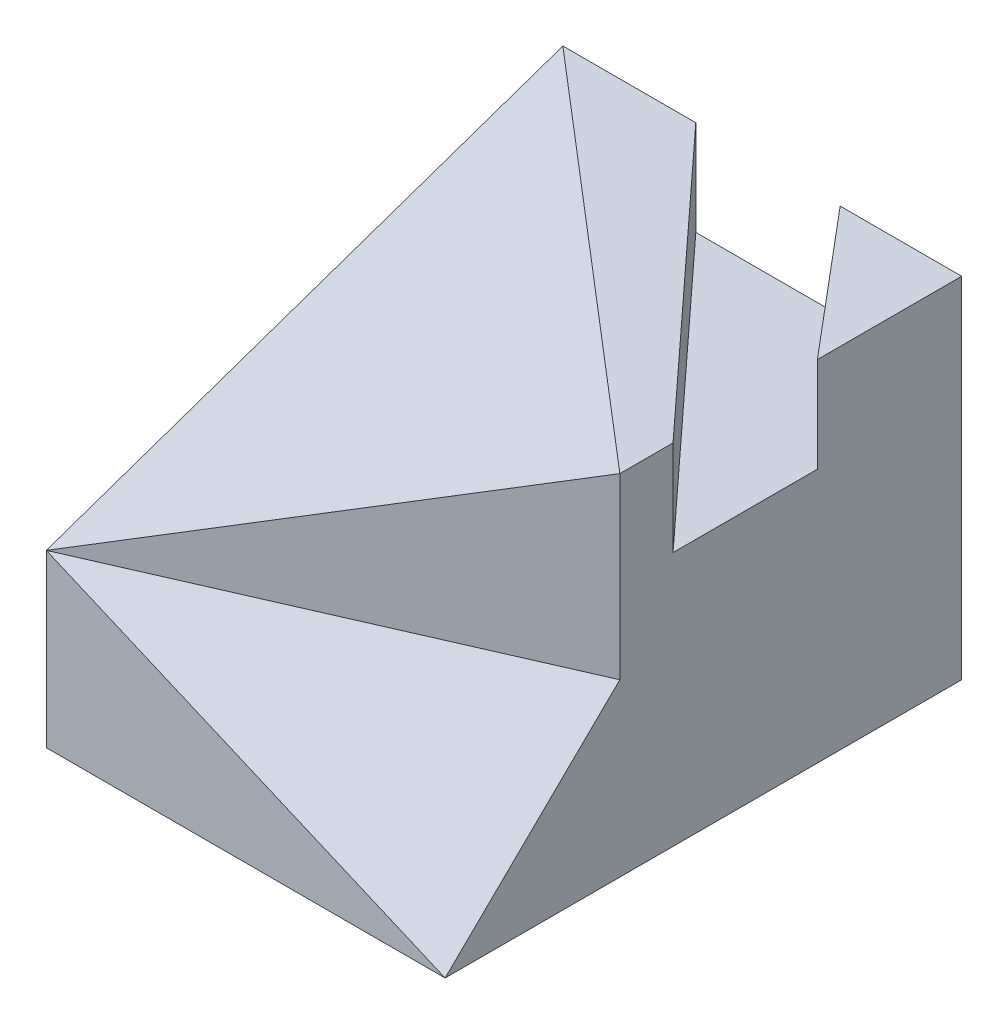
ISO-10303-21;
HEADER;
FILE_DESCRIPTION(('STEP AP214'),'2;1');
FILE_NAME('part.step','',(''),(''),'','','');
FILE_SCHEMA(('AUTOMOTIVE_DESIGN { 1 0 10303 214 1 1 1 1 }'));
ENDSEC;
DATA;
#1=APPLICATION_CONTEXT('core data for automotive mechanical design processes');
#2=APPLICATION_PROTOCOL_DEFINITION('international standard','automotive_design',2000,#1);
#3=PRODUCT_CONTEXT('',#1,'mechanical');
#4=PRODUCT('Part','Part','',(#3));
#5=PRODUCT_RELATED_PRODUCT_CATEGORY('part','',(#4));
#6=PRODUCT_DEFINITION_FORMATION('','',#4);
#7=PRODUCT_DEFINITION_CONTEXT('part definition',#1,'design');
#8=PRODUCT_DEFINITION('design','',#6,#7);
#9=PRODUCT_DEFINITION_SHAPE('','',#8);
#10=(LENGTH_UNIT() NAMED_UNIT(*) SI_UNIT(.MILLI.,.METRE.));
#11=(NAMED_UNIT(*) PLANE_ANGLE_UNIT() SI_UNIT($,.RADIAN.));
#12=(NAMED_UNIT(*) SI_UNIT($,.STERADIAN.) SOLID_ANGLE_UNIT());
#13=UNCERTAINTY_MEASURE_WITH_UNIT(LENGTH_MEASURE(1.E-05),#10,'distance_accuracy_value','');
#14=(GEOMETRIC_REPRESENTATION_CONTEXT(3) GLOBAL_UNCERTAINTY_ASSIGNED_CONTEXT((#13)) GLOBAL_UNIT_ASSIGNED_CONTEXT((#10,
#11,#12)) REPRESENTATION_CONTEXT('',''));
#15=CARTESIAN_POINT('',(0.,0.,0.));
#16=DIRECTION('',(0.,0.,1.));
#17=DIRECTION('',(1.,0.,0.));
#18=AXIS2_PLACEMENT_3D('',#15,#16,#17);
#19=CARTESIAN_POINT('',(-26.25,23.,68.));
#20=DIRECTION('',(0.,-1.,0.));
#21=DIRECTION('',(0.,0.,-1.));
#22=AXIS2_PLACEMENT_3D('',#19,#20,#21);
#23=PLANE('',#22);
#24=DIRECTION('',(-1.,0.,0.));
#25=VECTOR('',#24,1.);
#26=CARTESIAN_POINT('',(-26.25,23.,0.));
#27=LINE('',#26,#25);
#28=CARTESIAN_POINT('',(26.25,23.,0.));
#29=VERTEX_POINT('',#28);
#30=CARTESIAN_POINT('',(10.25,23.,0.));
#31=VERTEX_POINT('',#30);
#32=EDGE_CURVE('E89',#29,#31,#27,.T.);
#33=ORIENTED_EDGE('',*,*,#32,.T.);
#34=DIRECTION('',(-0.64413574578278,0.,-0.764911198117051));
#35=VECTOR('',#34,1.);
#36=CARTESIAN_POINT('',(10.25,23.,0.));
#37=LINE('',#36,#35);
#38=CARTESIAN_POINT('',(26.25,23.,19.));
#39=VERTEX_POINT('',#38);
#40=EDGE_CURVE('E235',#39,#31,#37,.T.);
#41=ORIENTED_EDGE('',*,*,#40,.F.);
#42=DIRECTION('',(0.,0.,-1.));
#43=VECTOR('',#42,1.);
#44=CARTESIAN_POINT('',(26.25,23.,68.));
#45=LINE('',#44,#43);
#46=EDGE_CURVE('E41',#39,#29,#45,.T.);
#47=ORIENTED_EDGE('',*,*,#46,.T.);
#48=EDGE_LOOP('',(#33,#41,#47));
#49=FACE_BOUND('',#48,.T.);
#50=ADVANCED_FACE('F37',(#49),#23,.F.);
#51=CARTESIAN_POINT('',(0.,0.,68.));
#52=DIRECTION('',(0.,0.,-1.));
#53=DIRECTION('',(-1.,0.,0.));
#54=AXIS2_PLACEMENT_3D('',#51,#52,#53);
#55=PLANE('',#54);
#56=DIRECTION('',(0.919145030018058,-0.393919298579168,0.));
#57=VECTOR('',#56,1.);
#58=CARTESIAN_POINT('',(-26.25,-0.499999999999988,68.));
#59=LINE('',#58,#57);
#60=CARTESIAN_POINT('',(-26.25,-0.499999999999988,68.));
#61=VERTEX_POINT('',#60);
#62=CARTESIAN_POINT('',(26.25,-23.,68.));
#63=VERTEX_POINT('',#62);
#64=EDGE_CURVE('E129',#61,#63,#59,.T.);
#65=ORIENTED_EDGE('',*,*,#64,.F.);
#66=DIRECTION('',(0.,-1.,0.));
#67=VECTOR('',#66,1.);
#68=CARTESIAN_POINT('',(-26.25,-23.,68.));
#69=LINE('',#68,#67);
#70=CARTESIAN_POINT('',(-26.25,-23.,68.));
#71=VERTEX_POINT('',#70);
#72=EDGE_CURVE('E63',#61,#71,#69,.T.);
#73=ORIENTED_EDGE('',*,*,#72,.T.);
#74=DIRECTION('',(1.,0.,0.));
#75=VECTOR('',#74,1.);
#76=CARTESIAN_POINT('',(-26.25,-23.,68.));
#77=LINE('',#76,#75);
#78=EDGE_CURVE('E95',#71,#63,#77,.T.);
#79=ORIENTED_EDGE('',*,*,#78,.T.);
#80=EDGE_LOOP('',(#65,#73,#79));
#81=FACE_BOUND('',#80,.T.);
#82=ADVANCED_FACE('F126',(#81),#55,.F.);
#83=CARTESIAN_POINT('',(26.25,-23.,68.));
#84=DIRECTION('',(-1.,0.,0.));
#85=DIRECTION('',(0.,0.,1.));
#86=AXIS2_PLACEMENT_3D('',#83,#84,#85);
#87=PLANE('',#86);
#88=ORIENTED_EDGE('',*,*,#46,.F.);
#89=DIRECTION('',(0.,1.,0.));
#90=VECTOR('',#89,1.);
#91=CARTESIAN_POINT('',(26.25,10.5,19.));
#92=LINE('',#91,#90);
#93=CARTESIAN_POINT('',(26.25,10.5,19.));
#94=VERTEX_POINT('',#93);
#95=EDGE_CURVE('E238',#94,#39,#92,.T.);
#96=ORIENTED_EDGE('',*,*,#95,.F.);
#97=DIRECTION('',(0.,0.,-1.));
#98=VECTOR('',#97,1.);
#99=CARTESIAN_POINT('',(26.25,10.5,19.));
#100=LINE('',#99,#98);
#101=CARTESIAN_POINT('',(26.25,10.5,38.));
#102=VERTEX_POINT('',#101);
#103=EDGE_CURVE('E230',#102,#94,#100,.T.);
#104=ORIENTED_EDGE('',*,*,#103,.F.);
#105=DIRECTION('',(0.,1.,0.));
#106=VECTOR('',#105,1.);
#107=CARTESIAN_POINT('',(26.25,10.5,38.));
#108=LINE('',#107,#106);
#109=CARTESIAN_POINT('',(26.25,23.,38.));
#110=VERTEX_POINT('',#109);
#111=EDGE_CURVE('E207',#102,#110,#108,.T.);
#112=ORIENTED_EDGE('',*,*,#111,.T.);
#113=CARTESIAN_POINT('',(26.25,23.,45.));
#114=VERTEX_POINT('',#113);
#115=EDGE_CURVE('E12',#114,#110,#45,.T.);
#116=ORIENTED_EDGE('',*,*,#115,.F.);
#117=DIRECTION('',(0.,1.,0.));
#118=VECTOR('',#117,1.);
#119=CARTESIAN_POINT('',(26.25,-0.499999999999997,45.));
#120=LINE('',#119,#118);
#121=CARTESIAN_POINT('',(26.25,-0.499999999999997,45.));
#122=VERTEX_POINT('',#121);
#123=EDGE_CURVE('E141',#122,#114,#120,.T.);
#124=ORIENTED_EDGE('',*,*,#123,.F.);
#125=DIRECTION('',(0.,-0.699294155463731,0.714834025585147));
#126=VECTOR('',#125,1.);
#127=CARTESIAN_POINT('',(26.25,-0.499999999999997,45.));
#128=LINE('',#127,#126);
#129=EDGE_CURVE('E137',#122,#63,#128,.T.);
#130=ORIENTED_EDGE('',*,*,#129,.T.);
#131=DIRECTION('',(0.,0.,-1.));
#132=VECTOR('',#131,1.);
#133=CARTESIAN_POINT('',(26.25,-23.,68.));
#134=LINE('',#133,#132);
#135=CARTESIAN_POINT('',(26.25,-23.,0.));
#136=VERTEX_POINT('',#135);
#137=EDGE_CURVE('E96',#63,#136,#134,.T.);
#138=ORIENTED_EDGE('',*,*,#137,.T.);
#139=DIRECTION('',(0.,1.,0.));
#140=VECTOR('',#139,1.);
#141=CARTESIAN_POINT('',(26.25,-23.,0.));
#142=LINE('',#141,#140);
#143=EDGE_CURVE('E103',#136,#29,#142,.T.);
#144=ORIENTED_EDGE('',*,*,#143,.T.);
#145=EDGE_LOOP('',(#88,#96,#104,#112,#116,#124,#130,#138,#144));
#146=FACE_BOUND('',#145,.T.);
#147=ADVANCED_FACE('F39',(#146),#87,.F.);
#148=ORIENTED_EDGE('',*,*,#115,.T.);
#149=DIRECTION('',(0.67747575475179,0.,0.735545105159087));
#150=VECTOR('',#149,1.);
#151=CARTESIAN_POINT('',(-8.75,23.,0.));
#152=LINE('',#151,#150);
#153=CARTESIAN_POINT('',(-8.75,23.,0.));
#154=VERTEX_POINT('',#153);
#155=EDGE_CURVE('E201',#154,#110,#152,.T.);
#156=ORIENTED_EDGE('',*,*,#155,.F.);
#157=CARTESIAN_POINT('',(-26.25,23.,0.));
#158=VERTEX_POINT('',#157);
#159=EDGE_CURVE('E113',#154,#158,#27,.T.);
#160=ORIENTED_EDGE('',*,*,#159,.T.);
#161=DIRECTION('',(0.759256602365297,0.,0.650791373455969));
#162=VECTOR('',#161,1.);
#163=CARTESIAN_POINT('',(-26.25,23.,0.));
#164=LINE('',#163,#162);
#165=EDGE_CURVE('E147',#158,#114,#164,.T.);
#166=ORIENTED_EDGE('',*,*,#165,.T.);
#167=EDGE_LOOP('',(#148,#156,#160,#166));
#168=FACE_BOUND('',#167,.T.);
#169=ADVANCED_FACE('F185',(#168),#23,.F.);
#170=CARTESIAN_POINT('',(-26.25,-23.,68.));
#171=DIRECTION('',(1.,0.,0.));
#172=DIRECTION('',(0.,0.,-1.));
#173=AXIS2_PLACEMENT_3D('',#170,#171,#172);
#174=PLANE('',#173);
#175=ORIENTED_EDGE('',*,*,#72,.F.);
#176=DIRECTION('',(0.,0.326633135958244,-0.945151201921726));
#177=VECTOR('',#176,1.);
#178=CARTESIAN_POINT('',(-26.25,23.,0.));
#179=LINE('',#178,#177);
#180=EDGE_CURVE('E84',#61,#158,#179,.T.);
#181=ORIENTED_EDGE('',*,*,#180,.T.);
#182=DIRECTION('',(0.,-1.,0.));
#183=VECTOR('',#182,1.);
#184=CARTESIAN_POINT('',(-26.25,-23.,0.));
#185=LINE('',#184,#183);
#186=CARTESIAN_POINT('',(-26.25,-23.,0.));
#187=VERTEX_POINT('',#186);
#188=EDGE_CURVE('E78',#158,#187,#185,.T.);
#189=ORIENTED_EDGE('',*,*,#188,.T.);
#190=DIRECTION('',(0.,0.,-1.));
#191=VECTOR('',#190,1.);
#192=CARTESIAN_POINT('',(-26.25,-23.,68.));
#193=LINE('',#192,#191);
#194=EDGE_CURVE('E81',#71,#187,#193,.T.);
#195=ORIENTED_EDGE('',*,*,#194,.F.);
#196=EDGE_LOOP('',(#175,#181,#189,#195));
#197=FACE_BOUND('',#196,.T.);
#198=ADVANCED_FACE('F80',(#197),#174,.F.);
#199=CARTESIAN_POINT('',(-26.25,-23.,68.));
#200=DIRECTION('',(0.,1.,0.));
#201=DIRECTION('',(0.,0.,1.));
#202=AXIS2_PLACEMENT_3D('',#199,#200,#201);
#203=PLANE('',#202);
#204=DIRECTION('',(1.,0.,0.));
#205=VECTOR('',#204,1.);
#206=CARTESIAN_POINT('',(-26.25,-23.,0.));
#207=LINE('',#206,#205);
#208=EDGE_CURVE('E88',#187,#136,#207,.T.);
#209=ORIENTED_EDGE('',*,*,#208,.T.);
#210=ORIENTED_EDGE('',*,*,#137,.F.);
#211=ORIENTED_EDGE('',*,*,#78,.F.);
#212=ORIENTED_EDGE('',*,*,#194,.T.);
#213=EDGE_LOOP('',(#209,#210,#211,#212));
#214=FACE_BOUND('',#213,.T.);
#215=ADVANCED_FACE('F92',(#214),#203,.F.);
#216=CARTESIAN_POINT('',(0.,0.,0.));
#217=DIRECTION('',(0.,0.,-1.));
#218=DIRECTION('',(-1.,0.,0.));
#219=AXIS2_PLACEMENT_3D('',#216,#217,#218);
#220=PLANE('',#219);
#221=DIRECTION('',(0.,1.,0.));
#222=VECTOR('',#221,1.);
#223=CARTESIAN_POINT('',(10.25,10.5,0.));
#224=LINE('',#223,#222);
#225=CARTESIAN_POINT('',(10.25,10.5,0.));
#226=VERTEX_POINT('',#225);
#227=EDGE_CURVE('E244',#226,#31,#224,.T.);
#228=ORIENTED_EDGE('',*,*,#227,.T.);
#229=ORIENTED_EDGE('',*,*,#32,.F.);
#230=ORIENTED_EDGE('',*,*,#143,.F.);
#231=ORIENTED_EDGE('',*,*,#208,.F.);
#232=ORIENTED_EDGE('',*,*,#188,.F.);
#233=ORIENTED_EDGE('',*,*,#159,.F.);
#234=DIRECTION('',(0.,1.,0.));
#235=VECTOR('',#234,1.);
#236=CARTESIAN_POINT('',(-8.75,10.5,0.));
#237=LINE('',#236,#235);
#238=CARTESIAN_POINT('',(-8.75,10.5,0.));
#239=VERTEX_POINT('',#238);
#240=EDGE_CURVE('E229',#239,#154,#237,.T.);
#241=ORIENTED_EDGE('',*,*,#240,.F.);
#242=DIRECTION('',(-1.,0.,0.));
#243=VECTOR('',#242,1.);
#244=CARTESIAN_POINT('',(10.25,10.5,0.));
#245=LINE('',#244,#243);
#246=EDGE_CURVE('E231',#226,#239,#245,.T.);
#247=ORIENTED_EDGE('',*,*,#246,.F.);
#248=EDGE_LOOP('',(#228,#229,#230,#231,#232,#233,#241,#247));
#249=FACE_BOUND('',#248,.T.);
#250=ADVANCED_FACE('F100',(#249),#220,.T.);
#251=CARTESIAN_POINT('',(-7.5517878671272,25.4939788989543,8.81041917831508));
#252=DIRECTION('',(0.269604261127868,-0.91015339217635,-0.31453830464918));
#253=DIRECTION('',(0.,0.326633135958244,-0.945151201921726));
#254=AXIS2_PLACEMENT_3D('',#251,#252,#253);
#255=PLANE('',#254);
#256=ORIENTED_EDGE('',*,*,#165,.F.);
#257=ORIENTED_EDGE('',*,*,#180,.F.);
#258=DIRECTION('',(-0.847491027884825,-0.379353126767493,0.37128178364478));
#259=VECTOR('',#258,1.);
#260=CARTESIAN_POINT('',(26.25,23.,45.));
#261=LINE('',#260,#259);
#262=EDGE_CURVE('E159',#114,#61,#261,.T.);
#263=ORIENTED_EDGE('',*,*,#262,.F.);
#264=EDGE_LOOP('',(#256,#257,#263));
#265=FACE_BOUND('',#264,.T.);
#266=ADVANCED_FACE('F174',(#265),#255,.F.);
#267=CARTESIAN_POINT('',(10.965551265358,25.5862862858353,25.0300626709258));
#268=DIRECTION('',(0.292919697291404,0.683479293679943,0.668621048165161));
#269=DIRECTION('',(0.,-0.699294155463731,0.714834025585148));
#270=AXIS2_PLACEMENT_3D('',#267,#268,#269);
#271=PLANE('',#270);
#272=DIRECTION('',(0.915957011428414,0.,-0.401276405006734));
#273=VECTOR('',#272,1.);
#274=CARTESIAN_POINT('',(-26.25,-0.499999999999988,68.));
#275=LINE('',#274,#273);
#276=EDGE_CURVE('E144',#61,#122,#275,.T.);
#277=ORIENTED_EDGE('',*,*,#276,.F.);
#278=ORIENTED_EDGE('',*,*,#64,.T.);
#279=ORIENTED_EDGE('',*,*,#129,.F.);
#280=EDGE_LOOP('',(#277,#278,#279));
#281=FACE_BOUND('',#280,.T.);
#282=ADVANCED_FACE('F172',(#281),#271,.T.);
#283=CARTESIAN_POINT('',(20.7666844227989,0.,47.4022144433453));
#284=DIRECTION('',(-0.401276405006734,0.,-0.915957011428414));
#285=DIRECTION('',(-0.915957011428414,0.,0.401276405006734));
#286=AXIS2_PLACEMENT_3D('',#283,#284,#285);
#287=PLANE('',#286);
#288=ORIENTED_EDGE('',*,*,#262,.T.);
#289=ORIENTED_EDGE('',*,*,#276,.T.);
#290=ORIENTED_EDGE('',*,*,#123,.T.);
#291=EDGE_LOOP('',(#288,#289,#290));
#292=FACE_BOUND('',#291,.T.);
#293=ADVANCED_FACE('F169',(#292),#287,.F.);
#294=CARTESIAN_POINT('',(10.25,10.5,0.));
#295=DIRECTION('',(0.764911198117051,0.,-0.64413574578278));
#296=DIRECTION('',(-0.64413574578278,0.,-0.764911198117051));
#297=AXIS2_PLACEMENT_3D('',#294,#295,#296);
#298=PLANE('',#297);
#299=ORIENTED_EDGE('',*,*,#40,.T.);
#300=ORIENTED_EDGE('',*,*,#227,.F.);
#301=DIRECTION('',(-0.64413574578278,0.,-0.764911198117051));
#302=VECTOR('',#301,1.);
#303=CARTESIAN_POINT('',(10.25,10.5,0.));
#304=LINE('',#303,#302);
#305=EDGE_CURVE('E54',#94,#226,#304,.T.);
#306=ORIENTED_EDGE('',*,*,#305,.F.);
#307=ORIENTED_EDGE('',*,*,#95,.T.);
#308=EDGE_LOOP('',(#299,#300,#306,#307));
#309=FACE_BOUND('',#308,.T.);
#310=ADVANCED_FACE('F180',(#309),#298,.F.);
#311=CARTESIAN_POINT('',(-8.75,10.5,0.));
#312=DIRECTION('',(-0.735545105159087,0.,0.677475754751791));
#313=DIRECTION('',(0.67747575475179,0.,0.735545105159087));
#314=AXIS2_PLACEMENT_3D('',#311,#312,#313);
#315=PLANE('',#314);
#316=ORIENTED_EDGE('',*,*,#155,.T.);
#317=ORIENTED_EDGE('',*,*,#111,.F.);
#318=DIRECTION('',(0.67747575475179,0.,0.735545105159087));
#319=VECTOR('',#318,1.);
#320=CARTESIAN_POINT('',(-8.75,10.5,0.));
#321=LINE('',#320,#319);
#322=EDGE_CURVE('E226',#239,#102,#321,.T.);
#323=ORIENTED_EDGE('',*,*,#322,.F.);
#324=ORIENTED_EDGE('',*,*,#240,.T.);
#325=EDGE_LOOP('',(#316,#317,#323,#324));
#326=FACE_BOUND('',#325,.T.);
#327=ADVANCED_FACE('F227',(#326),#315,.F.);
#328=CARTESIAN_POINT('',(0.,10.5,0.));
#329=DIRECTION('',(0.,1.,0.));
#330=DIRECTION('',(0.,0.,1.));
#331=AXIS2_PLACEMENT_3D('',#328,#329,#330);
#332=PLANE('',#331);
#333=ORIENTED_EDGE('',*,*,#246,.T.);
#334=ORIENTED_EDGE('',*,*,#322,.T.);
#335=ORIENTED_EDGE('',*,*,#103,.T.);
#336=ORIENTED_EDGE('',*,*,#305,.T.);
#337=EDGE_LOOP('',(#333,#334,#335,#336));
#338=FACE_BOUND('',#337,.T.);
#339=ADVANCED_FACE('F234',(#338),#332,.T.);
#340=CLOSED_SHELL('',(#50,#82,#147,#169,#198,#215,#250,#266,#282,#293,#310,#327,#339));
#341=MANIFOLD_SOLID_BREP('B2',#340);
#342=ADVANCED_BREP_SHAPE_REPRESENTATION('',(#18,#341),#14);
#343=SHAPE_DEFINITION_REPRESENTATION(#9,#342);
ENDSEC;
END-ISO-10303-21;
